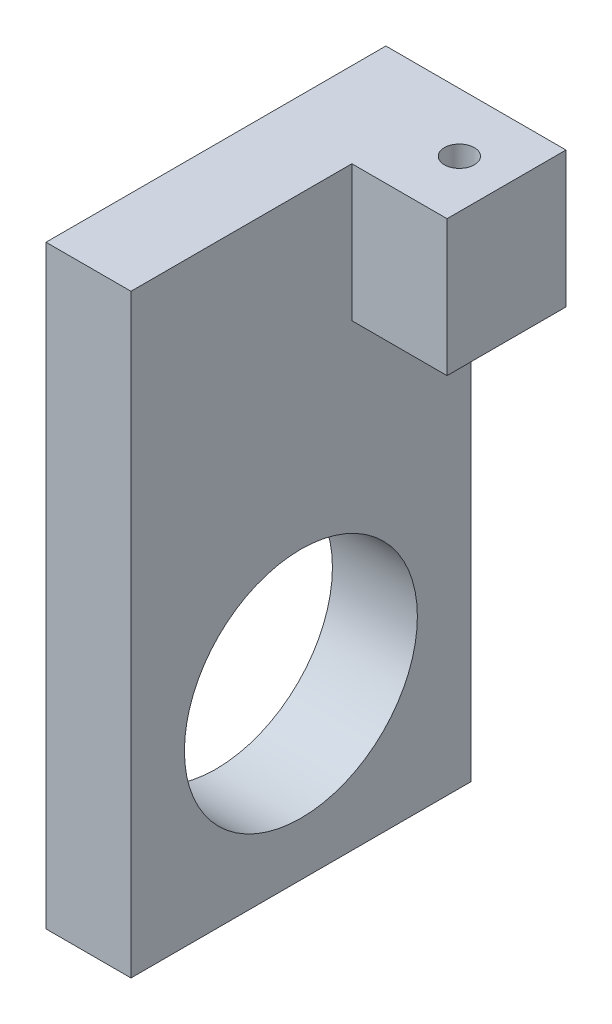
ISO-10303-21;
HEADER;
FILE_DESCRIPTION(('STEP AP214'),'2;1');
FILE_NAME('part.step','',(''),(''),'','','');
FILE_SCHEMA(('AUTOMOTIVE_DESIGN { 1 0 10303 214 1 1 1 1 }'));
ENDSEC;
DATA;
#1=APPLICATION_CONTEXT('core data for automotive mechanical design processes');
#2=APPLICATION_PROTOCOL_DEFINITION('international standard','automotive_design',2000,#1);
#3=PRODUCT_CONTEXT('',#1,'mechanical');
#4=PRODUCT('Part','Part','',(#3));
#5=PRODUCT_RELATED_PRODUCT_CATEGORY('part','',(#4));
#6=PRODUCT_DEFINITION_FORMATION('','',#4);
#7=PRODUCT_DEFINITION_CONTEXT('part definition',#1,'design');
#8=PRODUCT_DEFINITION('design','',#6,#7);
#9=PRODUCT_DEFINITION_SHAPE('','',#8);
#10=(LENGTH_UNIT() NAMED_UNIT(*) SI_UNIT(.MILLI.,.METRE.));
#11=(NAMED_UNIT(*) PLANE_ANGLE_UNIT() SI_UNIT($,.RADIAN.));
#12=(NAMED_UNIT(*) SI_UNIT($,.STERADIAN.) SOLID_ANGLE_UNIT());
#13=UNCERTAINTY_MEASURE_WITH_UNIT(LENGTH_MEASURE(1.E-05),#10,'distance_accuracy_value','');
#14=(GEOMETRIC_REPRESENTATION_CONTEXT(3) GLOBAL_UNCERTAINTY_ASSIGNED_CONTEXT((#13)) GLOBAL_UNIT_ASSIGNED_CONTEXT((#10,
#11,#12)) REPRESENTATION_CONTEXT('',''));
#15=CARTESIAN_POINT('',(0.,0.,0.));
#16=DIRECTION('',(0.,0.,1.));
#17=DIRECTION('',(1.,0.,0.));
#18=AXIS2_PLACEMENT_3D('',#15,#16,#17);
#19=CARTESIAN_POINT('',(-2.37547690560455,-32.4424041901126,22.2064768127229));
#20=DIRECTION('',(-1.,0.,0.));
#21=DIRECTION('',(0.,0.,1.));
#22=AXIS2_PLACEMENT_3D('',#19,#20,#21);
#23=PLANE('',#22);
#24=CARTESIAN_POINT('',(-2.37547690560455,-19.7424041901126,9.50647681272291));
#25=DIRECTION('',(1.,0.,0.));
#26=DIRECTION('',(0.,1.,0.));
#27=AXIS2_PLACEMENT_3D('',#24,#25,#26);
#28=CIRCLE('',#27,8.70585);
#29=CARTESIAN_POINT('',(-2.37547690560455,-11.0365541901126,9.50647681272291));
#30=VERTEX_POINT('',#29);
#31=EDGE_CURVE('E220',#30,#30,#28,.T.);
#32=ORIENTED_EDGE('',*,*,#31,.F.);
#33=EDGE_LOOP('',(#32));
#34=FACE_BOUND('',#33,.T.);
#35=DIRECTION('',(0.,0.,-1.));
#36=VECTOR('',#35,1.);
#37=CARTESIAN_POINT('',(-2.37547690560455,1.84759580988739,-3.19352318727706));
#38=LINE('',#37,#36);
#39=CARTESIAN_POINT('',(-2.37547690560455,1.84759580988739,5.69647681272294));
#40=VERTEX_POINT('',#39);
#41=CARTESIAN_POINT('',(-2.37547690560455,1.84759580988739,-3.19352318727709));
#42=VERTEX_POINT('',#41);
#43=EDGE_CURVE('E121',#40,#42,#38,.T.);
#44=ORIENTED_EDGE('',*,*,#43,.F.);
#45=DIRECTION('',(0.,-1.,0.));
#46=VECTOR('',#45,1.);
#47=CARTESIAN_POINT('',(-2.37547690560455,12.0075958098874,5.69647681272294));
#48=LINE('',#47,#46);
#49=CARTESIAN_POINT('',(-2.37547690560455,12.0075958098874,5.69647681272294));
#50=VERTEX_POINT('',#49);
#51=EDGE_CURVE('E50',#50,#40,#48,.T.);
#52=ORIENTED_EDGE('',*,*,#51,.F.);
#53=DIRECTION('',(0.,0.,-1.));
#54=VECTOR('',#53,1.);
#55=CARTESIAN_POINT('',(-2.37547690560455,12.0075958098874,22.2064768127229));
#56=LINE('',#55,#54);
#57=CARTESIAN_POINT('',(-2.37547690560455,12.0075958098874,22.2064768127229));
#58=VERTEX_POINT('',#57);
#59=EDGE_CURVE('E148',#58,#50,#56,.T.);
#60=ORIENTED_EDGE('',*,*,#59,.F.);
#61=DIRECTION('',(0.,1.,0.));
#62=VECTOR('',#61,1.);
#63=CARTESIAN_POINT('',(-2.37547690560455,-32.4424041901126,22.2064768127229));
#64=LINE('',#63,#62);
#65=CARTESIAN_POINT('',(-2.37547690560455,-32.4424041901126,22.2064768127229));
#66=VERTEX_POINT('',#65);
#67=EDGE_CURVE('E158',#66,#58,#64,.T.);
#68=ORIENTED_EDGE('',*,*,#67,.F.);
#69=DIRECTION('',(0.,0.,-1.));
#70=VECTOR('',#69,1.);
#71=CARTESIAN_POINT('',(-2.37547690560455,-32.4424041901126,22.2064768127229));
#72=LINE('',#71,#70);
#73=CARTESIAN_POINT('',(-2.37547690560455,-32.4424041901126,-3.19352318727709));
#74=VERTEX_POINT('',#73);
#75=EDGE_CURVE('E42',#66,#74,#72,.T.);
#76=ORIENTED_EDGE('',*,*,#75,.T.);
#77=DIRECTION('',(0.,1.,0.));
#78=VECTOR('',#77,1.);
#79=CARTESIAN_POINT('',(-2.37547690560455,-32.4424041901126,-3.19352318727709));
#80=LINE('',#79,#78);
#81=EDGE_CURVE('E56',#74,#42,#80,.T.);
#82=ORIENTED_EDGE('',*,*,#81,.T.);
#83=EDGE_LOOP('',(#44,#52,#60,#68,#76,#82));
#84=FACE_BOUND('',#83,.T.);
#85=ADVANCED_FACE('F33',(#34,#84),#23,.F.);
#86=CARTESIAN_POINT('',(-8.72547690560455,-32.4424041901126,22.2064768127229));
#87=DIRECTION('',(1.,0.,0.));
#88=DIRECTION('',(0.,0.,-1.));
#89=AXIS2_PLACEMENT_3D('',#86,#87,#88);
#90=PLANE('',#89);
#91=CARTESIAN_POINT('',(-8.72547690560456,-19.7424041901126,9.50647681272291));
#92=DIRECTION('',(1.,0.,0.));
#93=DIRECTION('',(0.,1.,0.));
#94=AXIS2_PLACEMENT_3D('',#91,#92,#93);
#95=CIRCLE('',#94,8.70585);
#96=CARTESIAN_POINT('',(-8.72547690560456,-11.0365541901126,9.50647681272291));
#97=VERTEX_POINT('',#96);
#98=EDGE_CURVE('E125',#97,#97,#95,.F.);
#99=ORIENTED_EDGE('',*,*,#98,.F.);
#100=EDGE_LOOP('',(#99));
#101=FACE_BOUND('',#100,.T.);
#102=DIRECTION('',(0.,-1.,0.));
#103=VECTOR('',#102,1.);
#104=CARTESIAN_POINT('',(-8.72547690560455,-32.4424041901126,-3.19352318727709));
#105=LINE('',#104,#103);
#106=CARTESIAN_POINT('',(-8.72547690560455,12.0075958098874,-3.19352318727709));
#107=VERTEX_POINT('',#106);
#108=CARTESIAN_POINT('',(-8.72547690560455,-32.4424041901126,-3.19352318727709));
#109=VERTEX_POINT('',#108);
#110=EDGE_CURVE('E102',#107,#109,#105,.T.);
#111=ORIENTED_EDGE('',*,*,#110,.T.);
#112=DIRECTION('',(0.,0.,-1.));
#113=VECTOR('',#112,1.);
#114=CARTESIAN_POINT('',(-8.72547690560455,-32.4424041901126,22.2064768127229));
#115=LINE('',#114,#113);
#116=CARTESIAN_POINT('',(-8.72547690560455,-32.4424041901126,22.2064768127229));
#117=VERTEX_POINT('',#116);
#118=EDGE_CURVE('E11',#117,#109,#115,.T.);
#119=ORIENTED_EDGE('',*,*,#118,.F.);
#120=DIRECTION('',(0.,-1.,0.));
#121=VECTOR('',#120,1.);
#122=CARTESIAN_POINT('',(-8.72547690560455,-32.4424041901126,22.2064768127229));
#123=LINE('',#122,#121);
#124=CARTESIAN_POINT('',(-8.72547690560455,12.0075958098874,22.2064768127229));
#125=VERTEX_POINT('',#124);
#126=EDGE_CURVE('E106',#125,#117,#123,.T.);
#127=ORIENTED_EDGE('',*,*,#126,.F.);
#128=DIRECTION('',(0.,0.,-1.));
#129=VECTOR('',#128,1.);
#130=CARTESIAN_POINT('',(-8.72547690560455,12.0075958098874,22.2064768127229));
#131=LINE('',#130,#129);
#132=EDGE_CURVE('E151',#125,#107,#131,.T.);
#133=ORIENTED_EDGE('',*,*,#132,.T.);
#134=EDGE_LOOP('',(#111,#119,#127,#133));
#135=FACE_BOUND('',#134,.T.);
#136=ADVANCED_FACE('F35',(#101,#135),#90,.F.);
#137=CARTESIAN_POINT('',(-8.72547690560455,-32.4424041901126,22.2064768127229));
#138=DIRECTION('',(0.,1.,0.));
#139=DIRECTION('',(0.,0.,1.));
#140=AXIS2_PLACEMENT_3D('',#137,#138,#139);
#141=PLANE('',#140);
#142=DIRECTION('',(1.,0.,0.));
#143=VECTOR('',#142,1.);
#144=CARTESIAN_POINT('',(-8.72547690560455,-32.4424041901126,-3.19352318727709));
#145=LINE('',#144,#143);
#146=EDGE_CURVE('E142',#109,#74,#145,.T.);
#147=ORIENTED_EDGE('',*,*,#146,.T.);
#148=ORIENTED_EDGE('',*,*,#75,.F.);
#149=DIRECTION('',(1.,0.,0.));
#150=VECTOR('',#149,1.);
#151=CARTESIAN_POINT('',(-8.72547690560455,-32.4424041901126,22.2064768127229));
#152=LINE('',#151,#150);
#153=EDGE_CURVE('E166',#117,#66,#152,.T.);
#154=ORIENTED_EDGE('',*,*,#153,.F.);
#155=ORIENTED_EDGE('',*,*,#118,.T.);
#156=EDGE_LOOP('',(#147,#148,#154,#155));
#157=FACE_BOUND('',#156,.T.);
#158=ADVANCED_FACE('F174',(#157),#141,.F.);
#159=CARTESIAN_POINT('',(-8.72547690560455,12.0075958098874,22.2064768127229));
#160=DIRECTION('',(0.,-1.,0.));
#161=DIRECTION('',(0.,0.,-1.));
#162=AXIS2_PLACEMENT_3D('',#159,#160,#161);
#163=PLANE('',#162);
#164=CARTESIAN_POINT('',(1.15512309439551,12.0075958098874,1.19296350741484));
#165=DIRECTION('',(0.,1.,0.));
#166=DIRECTION('',(0.,0.,1.));
#167=AXIS2_PLACEMENT_3D('',#164,#165,#166);
#168=CIRCLE('',#167,1.1176);
#169=CARTESIAN_POINT('',(1.15512309439551,12.0075958098874,2.31056350741484));
#170=VERTEX_POINT('',#169);
#171=EDGE_CURVE('E218',#170,#170,#168,.T.);
#172=ORIENTED_EDGE('',*,*,#171,.F.);
#173=EDGE_LOOP('',(#172));
#174=FACE_BOUND('',#173,.T.);
#175=DIRECTION('',(-1.,0.,0.));
#176=VECTOR('',#175,1.);
#177=CARTESIAN_POINT('',(-8.72547690560455,12.0075958098874,-3.19352318727709));
#178=LINE('',#177,#176);
#179=CARTESIAN_POINT('',(4.73652309439545,12.0075958098874,-3.19352318727706));
#180=VERTEX_POINT('',#179);
#181=EDGE_CURVE('E95',#180,#107,#178,.T.);
#182=ORIENTED_EDGE('',*,*,#181,.T.);
#183=ORIENTED_EDGE('',*,*,#132,.F.);
#184=DIRECTION('',(-1.,0.,0.));
#185=VECTOR('',#184,1.);
#186=CARTESIAN_POINT('',(-8.72547690560455,12.0075958098874,22.2064768127229));
#187=LINE('',#186,#185);
#188=EDGE_CURVE('E163',#58,#125,#187,.T.);
#189=ORIENTED_EDGE('',*,*,#188,.F.);
#190=ORIENTED_EDGE('',*,*,#59,.T.);
#191=DIRECTION('',(-1.,0.,0.));
#192=VECTOR('',#191,1.);
#193=CARTESIAN_POINT('',(4.73652309439545,12.0075958098874,5.69647681272294));
#194=LINE('',#193,#192);
#195=CARTESIAN_POINT('',(4.73652309439545,12.0075958098874,5.69647681272294));
#196=VERTEX_POINT('',#195);
#197=EDGE_CURVE('E112',#196,#50,#194,.T.);
#198=ORIENTED_EDGE('',*,*,#197,.F.);
#199=DIRECTION('',(0.,0.,1.));
#200=VECTOR('',#199,1.);
#201=CARTESIAN_POINT('',(4.73652309439545,12.0075958098874,-3.19352318727706));
#202=LINE('',#201,#200);
#203=EDGE_CURVE('E109',#180,#196,#202,.T.);
#204=ORIENTED_EDGE('',*,*,#203,.F.);
#205=EDGE_LOOP('',(#182,#183,#189,#190,#198,#204));
#206=FACE_BOUND('',#205,.T.);
#207=ADVANCED_FACE('F110',(#174,#206),#163,.F.);
#208=CARTESIAN_POINT('',(0.,0.,22.2064768127229));
#209=DIRECTION('',(0.,0.,-1.));
#210=DIRECTION('',(-1.,0.,0.));
#211=AXIS2_PLACEMENT_3D('',#208,#209,#210);
#212=PLANE('',#211);
#213=ORIENTED_EDGE('',*,*,#126,.T.);
#214=ORIENTED_EDGE('',*,*,#153,.T.);
#215=ORIENTED_EDGE('',*,*,#67,.T.);
#216=ORIENTED_EDGE('',*,*,#188,.T.);
#217=EDGE_LOOP('',(#213,#214,#215,#216));
#218=FACE_BOUND('',#217,.T.);
#219=ADVANCED_FACE('F171',(#218),#212,.F.);
#220=CARTESIAN_POINT('',(0.,0.,-3.19352318727709));
#221=DIRECTION('',(0.,0.,-1.));
#222=DIRECTION('',(-1.,0.,0.));
#223=AXIS2_PLACEMENT_3D('',#220,#221,#222);
#224=PLANE('',#223);
#225=ORIENTED_EDGE('',*,*,#110,.F.);
#226=ORIENTED_EDGE('',*,*,#181,.F.);
#227=DIRECTION('',(0.,1.,0.));
#228=VECTOR('',#227,1.);
#229=CARTESIAN_POINT('',(4.73652309439545,12.0075958098874,-3.19352318727706));
#230=LINE('',#229,#228);
#231=CARTESIAN_POINT('',(4.73652309439545,1.84759580988739,-3.19352318727706));
#232=VERTEX_POINT('',#231);
#233=EDGE_CURVE('E100',#232,#180,#230,.T.);
#234=ORIENTED_EDGE('',*,*,#233,.F.);
#235=DIRECTION('',(-1.,0.,0.));
#236=VECTOR('',#235,1.);
#237=CARTESIAN_POINT('',(4.73652309439545,1.84759580988739,-3.19352318727706));
#238=LINE('',#237,#236);
#239=EDGE_CURVE('E130',#232,#42,#238,.T.);
#240=ORIENTED_EDGE('',*,*,#239,.T.);
#241=ORIENTED_EDGE('',*,*,#81,.F.);
#242=ORIENTED_EDGE('',*,*,#146,.F.);
#243=EDGE_LOOP('',(#225,#226,#234,#240,#241,#242));
#244=FACE_BOUND('',#243,.T.);
#245=ADVANCED_FACE('F97',(#244),#224,.T.);
#246=CARTESIAN_POINT('',(4.73652309439545,12.0075958098874,5.69647681272294));
#247=DIRECTION('',(0.,0.,-1.));
#248=DIRECTION('',(0.,1.,0.));
#249=AXIS2_PLACEMENT_3D('',#246,#247,#248);
#250=PLANE('',#249);
#251=ORIENTED_EDGE('',*,*,#51,.T.);
#252=DIRECTION('',(-1.,0.,0.));
#253=VECTOR('',#252,1.);
#254=CARTESIAN_POINT('',(4.73652309439545,1.84759580988739,5.69647681272294));
#255=LINE('',#254,#253);
#256=CARTESIAN_POINT('',(4.73652309439545,1.84759580988739,5.69647681272294));
#257=VERTEX_POINT('',#256);
#258=EDGE_CURVE('E133',#257,#40,#255,.T.);
#259=ORIENTED_EDGE('',*,*,#258,.F.);
#260=DIRECTION('',(0.,-1.,0.));
#261=VECTOR('',#260,1.);
#262=CARTESIAN_POINT('',(4.73652309439545,12.0075958098874,5.69647681272294));
#263=LINE('',#262,#261);
#264=EDGE_CURVE('E115',#196,#257,#263,.T.);
#265=ORIENTED_EDGE('',*,*,#264,.F.);
#266=ORIENTED_EDGE('',*,*,#197,.T.);
#267=EDGE_LOOP('',(#251,#259,#265,#266));
#268=FACE_BOUND('',#267,.T.);
#269=ADVANCED_FACE('F192',(#268),#250,.F.);
#270=CARTESIAN_POINT('',(4.73652309439545,1.84759580988739,-3.19352318727706));
#271=DIRECTION('',(0.,1.,0.));
#272=DIRECTION('',(0.,0.,1.));
#273=AXIS2_PLACEMENT_3D('',#270,#271,#272);
#274=PLANE('',#273);
#275=CARTESIAN_POINT('',(1.15512309439551,1.84759580988739,1.19296350741484));
#276=DIRECTION('',(0.,1.,0.));
#277=DIRECTION('',(0.,0.,1.));
#278=AXIS2_PLACEMENT_3D('',#275,#276,#277);
#279=CIRCLE('',#278,1.1176);
#280=CARTESIAN_POINT('',(1.15512309439551,1.84759580988739,2.31056350741484));
#281=VERTEX_POINT('',#280);
#282=EDGE_CURVE('E215',#281,#281,#279,.F.);
#283=ORIENTED_EDGE('',*,*,#282,.F.);
#284=EDGE_LOOP('',(#283));
#285=FACE_BOUND('',#284,.T.);
#286=ORIENTED_EDGE('',*,*,#43,.T.);
#287=ORIENTED_EDGE('',*,*,#239,.F.);
#288=DIRECTION('',(0.,0.,-1.));
#289=VECTOR('',#288,1.);
#290=CARTESIAN_POINT('',(4.73652309439545,1.84759580988739,-3.19352318727706));
#291=LINE('',#290,#289);
#292=EDGE_CURVE('E119',#257,#232,#291,.T.);
#293=ORIENTED_EDGE('',*,*,#292,.F.);
#294=ORIENTED_EDGE('',*,*,#258,.T.);
#295=EDGE_LOOP('',(#286,#287,#293,#294));
#296=FACE_BOUND('',#295,.T.);
#297=ADVANCED_FACE('F197',(#285,#296),#274,.F.);
#298=CARTESIAN_POINT('',(4.73652309439545,0.,0.));
#299=DIRECTION('',(-1.,0.,0.));
#300=DIRECTION('',(0.,-1.,0.));
#301=AXIS2_PLACEMENT_3D('',#298,#299,#300);
#302=PLANE('',#301);
#303=ORIENTED_EDGE('',*,*,#233,.T.);
#304=ORIENTED_EDGE('',*,*,#203,.T.);
#305=ORIENTED_EDGE('',*,*,#264,.T.);
#306=ORIENTED_EDGE('',*,*,#292,.T.);
#307=EDGE_LOOP('',(#303,#304,#305,#306));
#308=FACE_BOUND('',#307,.T.);
#309=ADVANCED_FACE('F117',(#308),#302,.F.);
#310=CARTESIAN_POINT('',(-33.3493391895762,-19.7424041901126,9.50647681272291));
#311=DIRECTION('',(1.,0.,0.));
#312=DIRECTION('',(0.,1.,0.));
#313=AXIS2_PLACEMENT_3D('',#310,#311,#312);
#314=CYLINDRICAL_SURFACE('',#313,8.70585);
#315=ORIENTED_EDGE('',*,*,#98,.T.);
#316=EDGE_LOOP('',(#315));
#317=FACE_BOUND('',#316,.T.);
#318=ORIENTED_EDGE('',*,*,#31,.T.);
#319=EDGE_LOOP('',(#318));
#320=FACE_BOUND('',#319,.T.);
#321=ADVANCED_FACE('F203',(#317,#320),#314,.F.);
#322=CARTESIAN_POINT('',(1.15512309439551,-1.31345434472895,1.19296350741484));
#323=DIRECTION('',(0.,1.,0.));
#324=DIRECTION('',(0.,0.,1.));
#325=AXIS2_PLACEMENT_3D('',#322,#323,#324);
#326=CYLINDRICAL_SURFACE('',#325,1.1176);
#327=ORIENTED_EDGE('',*,*,#282,.T.);
#328=EDGE_LOOP('',(#327));
#329=FACE_BOUND('',#328,.T.);
#330=ORIENTED_EDGE('',*,*,#171,.T.);
#331=EDGE_LOOP('',(#330));
#332=FACE_BOUND('',#331,.T.);
#333=ADVANCED_FACE('F206',(#329,#332),#326,.F.);
#334=CLOSED_SHELL('',(#85,#136,#158,#207,#219,#245,#269,#297,#309,#321,#333));
#335=MANIFOLD_SOLID_BREP('B2',#334);
#336=ADVANCED_BREP_SHAPE_REPRESENTATION('',(#18,#335),#14);
#337=SHAPE_DEFINITION_REPRESENTATION(#9,#336);
ENDSEC;
END-ISO-10303-21;
